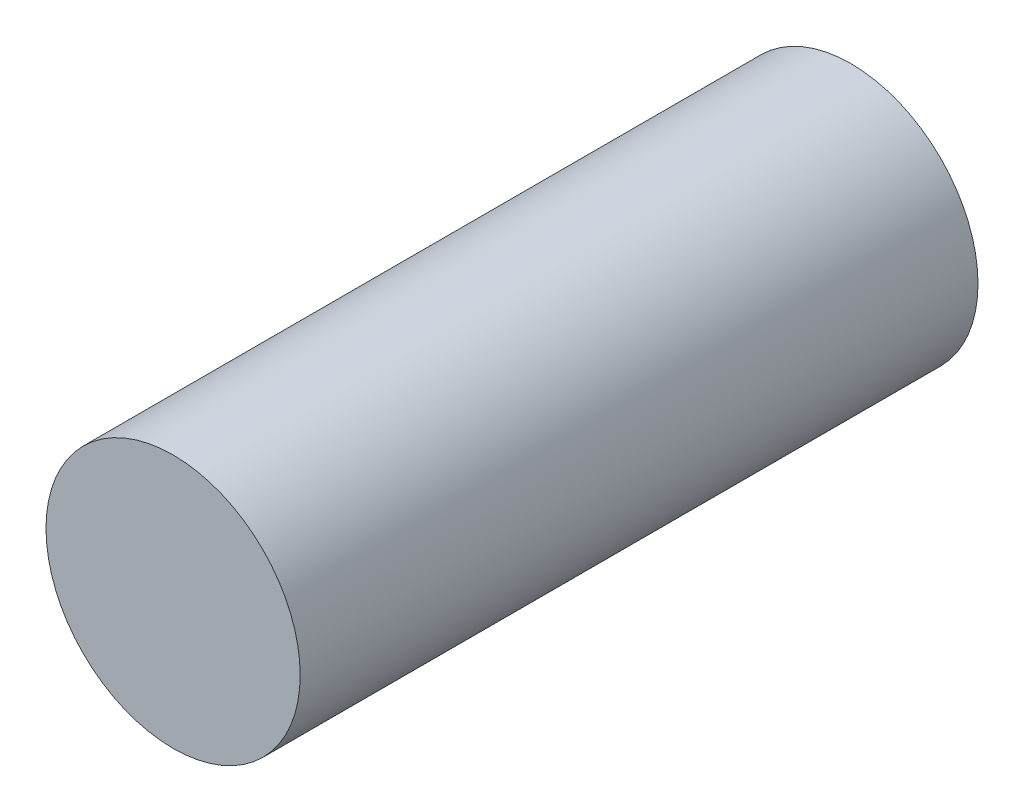
ISO-10303-21;
HEADER;
FILE_DESCRIPTION(('STEP AP214'),'2;1');
FILE_NAME('part.step','',(''),(''),'','','');
FILE_SCHEMA(('AUTOMOTIVE_DESIGN { 1 0 10303 214 1 1 1 1 }'));
ENDSEC;
DATA;
#1=APPLICATION_CONTEXT('core data for automotive mechanical design processes');
#2=APPLICATION_PROTOCOL_DEFINITION('international standard','automotive_design',2000,#1);
#3=PRODUCT_CONTEXT('',#1,'mechanical');
#4=PRODUCT('Part','Part','',(#3));
#5=PRODUCT_RELATED_PRODUCT_CATEGORY('part','',(#4));
#6=PRODUCT_DEFINITION_FORMATION('','',#4);
#7=PRODUCT_DEFINITION_CONTEXT('part definition',#1,'design');
#8=PRODUCT_DEFINITION('design','',#6,#7);
#9=PRODUCT_DEFINITION_SHAPE('','',#8);
#10=(LENGTH_UNIT() NAMED_UNIT(*) SI_UNIT(.MILLI.,.METRE.));
#11=(NAMED_UNIT(*) PLANE_ANGLE_UNIT() SI_UNIT($,.RADIAN.));
#12=(NAMED_UNIT(*) SI_UNIT($,.STERADIAN.) SOLID_ANGLE_UNIT());
#13=UNCERTAINTY_MEASURE_WITH_UNIT(LENGTH_MEASURE(1.E-05),#10,'distance_accuracy_value','');
#14=(GEOMETRIC_REPRESENTATION_CONTEXT(3) GLOBAL_UNCERTAINTY_ASSIGNED_CONTEXT((#13)) GLOBAL_UNIT_ASSIGNED_CONTEXT((#10,
#11,#12)) REPRESENTATION_CONTEXT('',''));
#15=CARTESIAN_POINT('',(0.,0.,0.));
#16=DIRECTION('',(0.,0.,1.));
#17=DIRECTION('',(1.,0.,0.));
#18=AXIS2_PLACEMENT_3D('',#15,#16,#17);
#19=CARTESIAN_POINT('',(-217.059834790128,-59.2454902999577,-10.));
#20=DIRECTION('',(0.,0.,1.));
#21=DIRECTION('',(1.,0.,0.));
#22=AXIS2_PLACEMENT_3D('',#19,#20,#21);
#23=CYLINDRICAL_SURFACE('',#22,3.75000000000001);
#24=CARTESIAN_POINT('',(-217.059834790128,-59.2454902999577,-10.));
#25=DIRECTION('',(0.,0.,1.));
#26=DIRECTION('',(1.,0.,0.));
#27=AXIS2_PLACEMENT_3D('',#24,#25,#26);
#28=CIRCLE('',#27,3.75000000000001);
#29=CARTESIAN_POINT('',(-213.309834790128,-59.2454902999577,-10.));
#30=VERTEX_POINT('',#29);
#31=EDGE_CURVE('E41',#30,#30,#28,.T.);
#32=ORIENTED_EDGE('',*,*,#31,.T.);
#33=EDGE_LOOP('',(#32));
#34=FACE_BOUND('',#33,.T.);
#35=CARTESIAN_POINT('',(-217.059834790128,-59.2454902999577,10.));
#36=DIRECTION('',(0.,0.,1.));
#37=DIRECTION('',(1.,0.,0.));
#38=AXIS2_PLACEMENT_3D('',#35,#36,#37);
#39=CIRCLE('',#38,3.75000000000001);
#40=CARTESIAN_POINT('',(-213.309834790128,-59.2454902999577,10.));
#41=VERTEX_POINT('',#40);
#42=EDGE_CURVE('E10',#41,#41,#39,.T.);
#43=ORIENTED_EDGE('',*,*,#42,.F.);
#44=EDGE_LOOP('',(#43));
#45=FACE_BOUND('',#44,.T.);
#46=ADVANCED_FACE('F34',(#34,#45),#23,.T.);
#47=CARTESIAN_POINT('',(-217.059834790128,-59.2454902999577,-10.));
#48=DIRECTION('',(0.,0.,1.));
#49=DIRECTION('',(1.,0.,0.));
#50=AXIS2_PLACEMENT_3D('',#47,#48,#49);
#51=PLANE('',#50);
#52=ORIENTED_EDGE('',*,*,#31,.F.);
#53=EDGE_LOOP('',(#52));
#54=FACE_BOUND('',#53,.T.);
#55=ADVANCED_FACE('F49',(#54),#51,.F.);
#56=CARTESIAN_POINT('',(-217.059834790128,-59.2454902999577,10.));
#57=DIRECTION('',(0.,0.,1.));
#58=DIRECTION('',(1.,0.,0.));
#59=AXIS2_PLACEMENT_3D('',#56,#57,#58);
#60=PLANE('',#59);
#61=ORIENTED_EDGE('',*,*,#42,.T.);
#62=EDGE_LOOP('',(#61));
#63=FACE_BOUND('',#62,.T.);
#64=ADVANCED_FACE('F36',(#63),#60,.T.);
#65=CLOSED_SHELL('',(#46,#55,#64));
#66=MANIFOLD_SOLID_BREP('B2',#65);
#67=ADVANCED_BREP_SHAPE_REPRESENTATION('',(#18,#66),#14);
#68=SHAPE_DEFINITION_REPRESENTATION(#9,#67);
ENDSEC;
END-ISO-10303-21;
